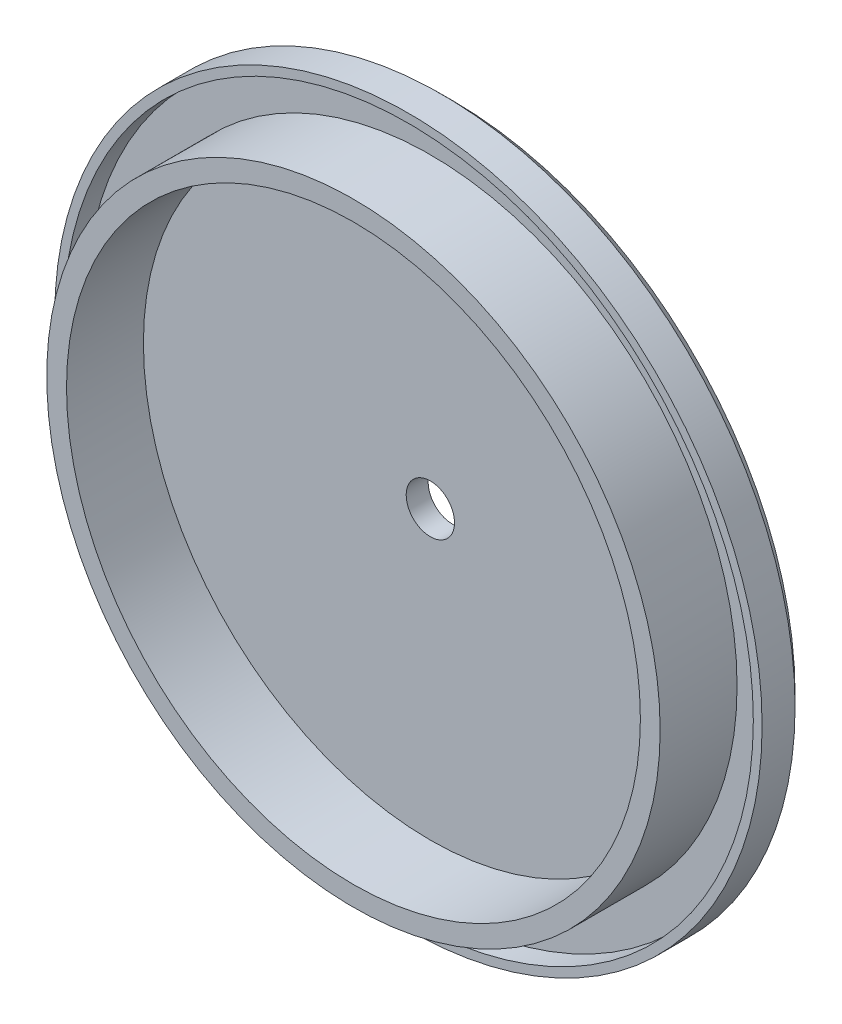
ISO-10303-21;
HEADER;
FILE_DESCRIPTION(('STEP AP214'),'2;1');
FILE_NAME('part.step','',(''),(''),'','','');
FILE_SCHEMA(('AUTOMOTIVE_DESIGN { 1 0 10303 214 1 1 1 1 }'));
ENDSEC;
DATA;
#1=APPLICATION_CONTEXT('core data for automotive mechanical design processes');
#2=APPLICATION_PROTOCOL_DEFINITION('international standard','automotive_design',2000,#1);
#3=PRODUCT_CONTEXT('',#1,'mechanical');
#4=PRODUCT('Part','Part','',(#3));
#5=PRODUCT_RELATED_PRODUCT_CATEGORY('part','',(#4));
#6=PRODUCT_DEFINITION_FORMATION('','',#4);
#7=PRODUCT_DEFINITION_CONTEXT('part definition',#1,'design');
#8=PRODUCT_DEFINITION('design','',#6,#7);
#9=PRODUCT_DEFINITION_SHAPE('','',#8);
#10=(LENGTH_UNIT() NAMED_UNIT(*) SI_UNIT(.MILLI.,.METRE.));
#11=(NAMED_UNIT(*) PLANE_ANGLE_UNIT() SI_UNIT($,.RADIAN.));
#12=(NAMED_UNIT(*) SI_UNIT($,.STERADIAN.) SOLID_ANGLE_UNIT());
#13=UNCERTAINTY_MEASURE_WITH_UNIT(LENGTH_MEASURE(1.E-05),#10,'distance_accuracy_value','');
#14=(GEOMETRIC_REPRESENTATION_CONTEXT(3) GLOBAL_UNCERTAINTY_ASSIGNED_CONTEXT((#13)) GLOBAL_UNIT_ASSIGNED_CONTEXT((#10,
#11,#12)) REPRESENTATION_CONTEXT('',''));
#15=CARTESIAN_POINT('',(0.,0.,0.));
#16=DIRECTION('',(0.,0.,1.));
#17=DIRECTION('',(1.,0.,0.));
#18=AXIS2_PLACEMENT_3D('',#15,#16,#17);
#19=CARTESIAN_POINT('',(0.,0.,-42.5495537373532));
#20=DIRECTION('',(0.,0.,-1.));
#21=DIRECTION('',(-1.,0.,0.));
#22=AXIS2_PLACEMENT_3D('',#19,#20,#21);
#23=PLANE('',#22);
#24=CARTESIAN_POINT('',(0.,0.,-42.5495537373532));
#25=DIRECTION('',(0.,0.,1.));
#26=DIRECTION('',(1.,0.,0.));
#27=AXIS2_PLACEMENT_3D('',#24,#25,#26);
#28=CIRCLE('',#27,27.92);
#29=CARTESIAN_POINT('',(27.92,0.,-42.5495537373532));
#30=VERTEX_POINT('',#29);
#31=EDGE_CURVE('E48',#30,#30,#28,.T.);
#32=ORIENTED_EDGE('',*,*,#31,.F.);
#33=EDGE_LOOP('',(#32));
#34=FACE_BOUND('',#33,.T.);
#35=CARTESIAN_POINT('',(0.,0.,-42.5495537373532));
#36=DIRECTION('',(0.,0.,1.));
#37=DIRECTION('',(1.,0.,0.));
#38=AXIS2_PLACEMENT_3D('',#35,#36,#37);
#39=CIRCLE('',#38,31.4);
#40=CARTESIAN_POINT('',(31.4,0.,-42.5495537373532));
#41=VERTEX_POINT('',#40);
#42=EDGE_CURVE('E66',#41,#41,#39,.T.);
#43=ORIENTED_EDGE('',*,*,#42,.T.);
#44=EDGE_LOOP('',(#43));
#45=FACE_BOUND('',#44,.T.);
#46=ADVANCED_FACE('F32',(#34,#45),#23,.F.);
#47=CARTESIAN_POINT('',(0.,0.,-35.5495537373532));
#48=DIRECTION('',(0.,0.,1.));
#49=DIRECTION('',(1.,0.,0.));
#50=AXIS2_PLACEMENT_3D('',#47,#48,#49);
#51=PLANE('',#50);
#52=CARTESIAN_POINT('',(0.,0.,-35.5495537373532));
#53=DIRECTION('',(0.,0.,1.));
#54=DIRECTION('',(1.,0.,0.));
#55=AXIS2_PLACEMENT_3D('',#52,#53,#54);
#56=CIRCLE('',#55,27.92);
#57=CARTESIAN_POINT('',(27.92,0.,-35.5495537373532));
#58=VERTEX_POINT('',#57);
#59=EDGE_CURVE('E45',#58,#58,#56,.T.);
#60=ORIENTED_EDGE('',*,*,#59,.T.);
#61=EDGE_LOOP('',(#60));
#62=FACE_BOUND('',#61,.T.);
#63=CARTESIAN_POINT('',(0.,0.,-35.5495537373532));
#64=DIRECTION('',(0.,0.,1.));
#65=DIRECTION('',(1.,0.,0.));
#66=AXIS2_PLACEMENT_3D('',#63,#64,#65);
#67=CIRCLE('',#66,26.12);
#68=CARTESIAN_POINT('',(26.12,0.,-35.5495537373532));
#69=VERTEX_POINT('',#68);
#70=EDGE_CURVE('E55',#69,#69,#67,.T.);
#71=ORIENTED_EDGE('',*,*,#70,.F.);
#72=EDGE_LOOP('',(#71));
#73=FACE_BOUND('',#72,.T.);
#74=ADVANCED_FACE('F88',(#62,#73),#51,.T.);
#75=CARTESIAN_POINT('',(0.,0.,-35.5495537373532));
#76=DIRECTION('',(0.,0.,-1.));
#77=DIRECTION('',(-1.,0.,0.));
#78=AXIS2_PLACEMENT_3D('',#75,#76,#77);
#79=CYLINDRICAL_SURFACE('',#78,27.92);
#80=ORIENTED_EDGE('',*,*,#59,.F.);
#81=EDGE_LOOP('',(#80));
#82=FACE_BOUND('',#81,.T.);
#83=ORIENTED_EDGE('',*,*,#31,.T.);
#84=EDGE_LOOP('',(#83));
#85=FACE_BOUND('',#84,.T.);
#86=ADVANCED_FACE('F95',(#82,#85),#79,.T.);
#87=CARTESIAN_POINT('',(0.,0.,-35.5495537373532));
#88=DIRECTION('',(0.,0.,-1.));
#89=DIRECTION('',(-1.,0.,0.));
#90=AXIS2_PLACEMENT_3D('',#87,#88,#89);
#91=CYLINDRICAL_SURFACE('',#90,26.12);
#92=ORIENTED_EDGE('',*,*,#70,.T.);
#93=EDGE_LOOP('',(#92));
#94=FACE_BOUND('',#93,.T.);
#95=CARTESIAN_POINT('',(0.,0.,-42.5495537373532));
#96=DIRECTION('',(0.,0.,1.));
#97=DIRECTION('',(1.,0.,0.));
#98=AXIS2_PLACEMENT_3D('',#95,#96,#97);
#99=CIRCLE('',#98,26.12);
#100=CARTESIAN_POINT('',(26.12,0.,-42.5495537373532));
#101=VERTEX_POINT('',#100);
#102=EDGE_CURVE('E51',#101,#101,#99,.T.);
#103=ORIENTED_EDGE('',*,*,#102,.F.);
#104=EDGE_LOOP('',(#103));
#105=FACE_BOUND('',#104,.T.);
#106=ADVANCED_FACE('F104',(#94,#105),#91,.F.);
#107=CARTESIAN_POINT('',(0.,0.,-42.5495537373532));
#108=DIRECTION('',(0.,0.,-1.));
#109=DIRECTION('',(-1.,0.,0.));
#110=AXIS2_PLACEMENT_3D('',#107,#108,#109);
#111=CIRCLE('',#110,2.2);
#112=CARTESIAN_POINT('',(-2.2,0.,-42.5495537373532));
#113=VERTEX_POINT('',#112);
#114=EDGE_CURVE('E52',#113,#113,#111,.F.);
#115=ORIENTED_EDGE('',*,*,#114,.F.);
#116=EDGE_LOOP('',(#115));
#117=FACE_BOUND('',#116,.T.);
#118=ORIENTED_EDGE('',*,*,#102,.T.);
#119=EDGE_LOOP('',(#118));
#120=FACE_BOUND('',#119,.T.);
#121=ADVANCED_FACE('F91',(#117,#120),#23,.F.);
#122=CARTESIAN_POINT('',(0.,0.,-44.5495537373532));
#123=DIRECTION('',(0.,0.,1.));
#124=DIRECTION('',(1.,0.,0.));
#125=AXIS2_PLACEMENT_3D('',#122,#123,#124);
#126=CYLINDRICAL_SURFACE('',#125,32.2);
#127=CARTESIAN_POINT('',(0.,0.,-43.5495537373532));
#128=DIRECTION('',(0.,0.,-1.));
#129=DIRECTION('',(-1.,0.,0.));
#130=AXIS2_PLACEMENT_3D('',#127,#128,#129);
#131=CIRCLE('',#130,32.2);
#132=CARTESIAN_POINT('',(-32.2,0.,-43.5495537373532));
#133=VERTEX_POINT('',#132);
#134=EDGE_CURVE('E10',#133,#133,#131,.F.);
#135=ORIENTED_EDGE('',*,*,#134,.T.);
#136=EDGE_LOOP('',(#135));
#137=FACE_BOUND('',#136,.T.);
#138=CARTESIAN_POINT('',(0.,0.,-40.5495537373532));
#139=DIRECTION('',(0.,0.,1.));
#140=DIRECTION('',(1.,0.,0.));
#141=AXIS2_PLACEMENT_3D('',#138,#139,#140);
#142=CIRCLE('',#141,32.2);
#143=CARTESIAN_POINT('',(32.2,0.,-40.5495537373532));
#144=VERTEX_POINT('',#143);
#145=EDGE_CURVE('E62',#144,#144,#142,.T.);
#146=ORIENTED_EDGE('',*,*,#145,.F.);
#147=EDGE_LOOP('',(#146));
#148=FACE_BOUND('',#147,.T.);
#149=ADVANCED_FACE('F103',(#137,#148),#126,.T.);
#150=CARTESIAN_POINT('',(0.,0.,-44.5495537373532));
#151=DIRECTION('',(0.,0.,-1.));
#152=DIRECTION('',(-1.,0.,0.));
#153=AXIS2_PLACEMENT_3D('',#150,#151,#152);
#154=PLANE('',#153);
#155=CARTESIAN_POINT('',(0.,0.,-44.5495537373532));
#156=DIRECTION('',(0.,0.,-1.));
#157=DIRECTION('',(-1.,0.,0.));
#158=AXIS2_PLACEMENT_3D('',#155,#156,#157);
#159=CIRCLE('',#158,2.2);
#160=CARTESIAN_POINT('',(-2.2,0.,-44.5495537373532));
#161=VERTEX_POINT('',#160);
#162=EDGE_CURVE('E37',#161,#161,#159,.F.);
#163=ORIENTED_EDGE('',*,*,#162,.T.);
#164=EDGE_LOOP('',(#163));
#165=FACE_BOUND('',#164,.T.);
#166=CARTESIAN_POINT('',(0.,0.,-44.5495537373532));
#167=DIRECTION('',(0.,0.,-1.));
#168=DIRECTION('',(-1.,0.,0.));
#169=AXIS2_PLACEMENT_3D('',#166,#167,#168);
#170=CIRCLE('',#169,31.2);
#171=CARTESIAN_POINT('',(-31.2,0.,-44.5495537373532));
#172=VERTEX_POINT('',#171);
#173=EDGE_CURVE('E41',#172,#172,#170,.T.);
#174=ORIENTED_EDGE('',*,*,#173,.T.);
#175=EDGE_LOOP('',(#174));
#176=FACE_BOUND('',#175,.T.);
#177=ADVANCED_FACE('F110',(#165,#176),#154,.T.);
#178=CARTESIAN_POINT('',(0.,0.,-44.5495537373532));
#179=DIRECTION('',(0.,0.,1.));
#180=DIRECTION('',(1.,0.,0.));
#181=AXIS2_PLACEMENT_3D('',#178,#179,#180);
#182=CONICAL_SURFACE('',#181,31.2,0.785398163397441);
#183=ORIENTED_EDGE('',*,*,#134,.F.);
#184=EDGE_LOOP('',(#183));
#185=FACE_BOUND('',#184,.T.);
#186=ORIENTED_EDGE('',*,*,#173,.F.);
#187=EDGE_LOOP('',(#186));
#188=FACE_BOUND('',#187,.T.);
#189=ADVANCED_FACE('F35',(#185,#188),#182,.T.);
#190=CARTESIAN_POINT('',(0.,0.,-91.5495537373532));
#191=DIRECTION('',(0.,0.,1.));
#192=DIRECTION('',(1.,0.,0.));
#193=AXIS2_PLACEMENT_3D('',#190,#191,#192);
#194=CYLINDRICAL_SURFACE('',#193,2.2);
#195=ORIENTED_EDGE('',*,*,#162,.F.);
#196=EDGE_LOOP('',(#195));
#197=FACE_BOUND('',#196,.T.);
#198=ORIENTED_EDGE('',*,*,#114,.T.);
#199=EDGE_LOOP('',(#198));
#200=FACE_BOUND('',#199,.T.);
#201=ADVANCED_FACE('F77',(#197,#200),#194,.F.);
#202=CARTESIAN_POINT('',(0.,0.,-40.5495537373532));
#203=DIRECTION('',(0.,0.,1.));
#204=DIRECTION('',(1.,0.,0.));
#205=AXIS2_PLACEMENT_3D('',#202,#203,#204);
#206=PLANE('',#205);
#207=ORIENTED_EDGE('',*,*,#145,.T.);
#208=EDGE_LOOP('',(#207));
#209=FACE_BOUND('',#208,.T.);
#210=CARTESIAN_POINT('',(0.,0.,-40.5495537373532));
#211=DIRECTION('',(0.,0.,1.));
#212=DIRECTION('',(1.,0.,0.));
#213=AXIS2_PLACEMENT_3D('',#210,#211,#212);
#214=CIRCLE('',#213,31.4);
#215=CARTESIAN_POINT('',(31.4,0.,-40.5495537373532));
#216=VERTEX_POINT('',#215);
#217=EDGE_CURVE('E65',#216,#216,#214,.T.);
#218=ORIENTED_EDGE('',*,*,#217,.F.);
#219=EDGE_LOOP('',(#218));
#220=FACE_BOUND('',#219,.T.);
#221=ADVANCED_FACE('F75',(#209,#220),#206,.T.);
#222=CARTESIAN_POINT('',(0.,0.,-40.5495537373532));
#223=DIRECTION('',(0.,0.,-1.));
#224=DIRECTION('',(-1.,0.,0.));
#225=AXIS2_PLACEMENT_3D('',#222,#223,#224);
#226=CYLINDRICAL_SURFACE('',#225,31.4);
#227=ORIENTED_EDGE('',*,*,#217,.T.);
#228=EDGE_LOOP('',(#227));
#229=FACE_BOUND('',#228,.T.);
#230=ORIENTED_EDGE('',*,*,#42,.F.);
#231=EDGE_LOOP('',(#230));
#232=FACE_BOUND('',#231,.T.);
#233=ADVANCED_FACE('F72',(#229,#232),#226,.F.);
#234=CLOSED_SHELL('',(#46,#74,#86,#106,#121,#149,#177,#189,#201,#221,#233));
#235=MANIFOLD_SOLID_BREP('B2',#234);
#236=ADVANCED_BREP_SHAPE_REPRESENTATION('',(#18,#235),#14);
#237=SHAPE_DEFINITION_REPRESENTATION(#9,#236);
ENDSEC;
END-ISO-10303-21;
